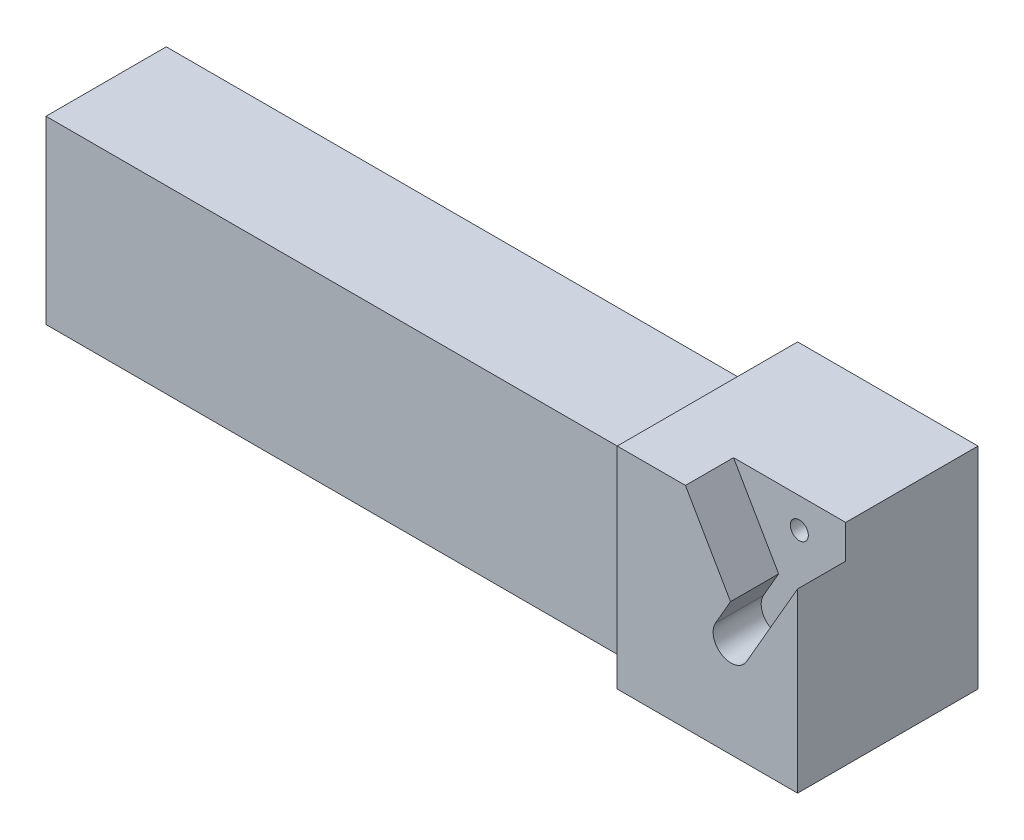
ISO-10303-21;
HEADER;
FILE_DESCRIPTION(('STEP AP214'),'2;1');
FILE_NAME('part.step','',(''),(''),'','','');
FILE_SCHEMA(('AUTOMOTIVE_DESIGN { 1 0 10303 214 1 1 1 1 }'));
ENDSEC;
DATA;
#1=APPLICATION_CONTEXT('core data for automotive mechanical design processes');
#2=APPLICATION_PROTOCOL_DEFINITION('international standard','automotive_design',2000,#1);
#3=PRODUCT_CONTEXT('',#1,'mechanical');
#4=PRODUCT('Part','Part','',(#3));
#5=PRODUCT_RELATED_PRODUCT_CATEGORY('part','',(#4));
#6=PRODUCT_DEFINITION_FORMATION('','',#4);
#7=PRODUCT_DEFINITION_CONTEXT('part definition',#1,'design');
#8=PRODUCT_DEFINITION('design','',#6,#7);
#9=PRODUCT_DEFINITION_SHAPE('','',#8);
#10=(LENGTH_UNIT() NAMED_UNIT(*) SI_UNIT(.MILLI.,.METRE.));
#11=(NAMED_UNIT(*) PLANE_ANGLE_UNIT() SI_UNIT($,.RADIAN.));
#12=(NAMED_UNIT(*) SI_UNIT($,.STERADIAN.) SOLID_ANGLE_UNIT());
#13=UNCERTAINTY_MEASURE_WITH_UNIT(LENGTH_MEASURE(1.E-05),#10,'distance_accuracy_value','');
#14=(GEOMETRIC_REPRESENTATION_CONTEXT(3) GLOBAL_UNCERTAINTY_ASSIGNED_CONTEXT((#13)) GLOBAL_UNIT_ASSIGNED_CONTEXT((#10,
#11,#12)) REPRESENTATION_CONTEXT('',''));
#15=CARTESIAN_POINT('',(0.,0.,0.));
#16=DIRECTION('',(0.,0.,1.));
#17=DIRECTION('',(1.,0.,0.));
#18=AXIS2_PLACEMENT_3D('',#15,#16,#17);
#19=CARTESIAN_POINT('',(-45.,15.,20.));
#20=DIRECTION('',(0.,-1.,0.));
#21=DIRECTION('',(0.,0.,-1.));
#22=AXIS2_PLACEMENT_3D('',#19,#20,#21);
#23=PLANE('',#22);
#24=DIRECTION('',(-1.,0.,0.));
#25=VECTOR('',#24,1.);
#26=CARTESIAN_POINT('',(-45.,15.,20.));
#27=LINE('',#26,#25);
#28=CARTESIAN_POINT('',(50.,15.,20.));
#29=VERTEX_POINT('',#28);
#30=CARTESIAN_POINT('',(-45.,15.,20.));
#31=VERTEX_POINT('',#30);
#32=EDGE_CURVE('E192',#29,#31,#27,.T.);
#33=ORIENTED_EDGE('',*,*,#32,.F.);
#34=DIRECTION('',(0.,0.,-1.));
#35=VECTOR('',#34,1.);
#36=CARTESIAN_POINT('',(50.,15.,0.));
#37=LINE('',#36,#35);
#38=CARTESIAN_POINT('',(50.,15.,0.));
#39=VERTEX_POINT('',#38);
#40=EDGE_CURVE('E216',#29,#39,#37,.T.);
#41=ORIENTED_EDGE('',*,*,#40,.T.);
#42=DIRECTION('',(-1.,0.,0.));
#43=VECTOR('',#42,1.);
#44=CARTESIAN_POINT('',(-45.,15.,0.));
#45=LINE('',#44,#43);
#46=CARTESIAN_POINT('',(-45.,15.,0.));
#47=VERTEX_POINT('',#46);
#48=EDGE_CURVE('E191',#39,#47,#45,.T.);
#49=ORIENTED_EDGE('',*,*,#48,.T.);
#50=DIRECTION('',(0.,0.,-1.));
#51=VECTOR('',#50,1.);
#52=CARTESIAN_POINT('',(-45.,15.,20.));
#53=LINE('',#52,#51);
#54=EDGE_CURVE('E204',#31,#47,#53,.T.);
#55=ORIENTED_EDGE('',*,*,#54,.F.);
#56=EDGE_LOOP('',(#33,#41,#49,#55));
#57=FACE_BOUND('',#56,.T.);
#58=ADVANCED_FACE('F36',(#57),#23,.F.);
#59=CARTESIAN_POINT('',(-45.,15.,20.));
#60=DIRECTION('',(1.,0.,0.));
#61=DIRECTION('',(0.,1.,0.));
#62=AXIS2_PLACEMENT_3D('',#59,#60,#61);
#63=PLANE('',#62);
#64=DIRECTION('',(0.,-1.,0.));
#65=VECTOR('',#64,1.);
#66=CARTESIAN_POINT('',(-45.,15.,0.));
#67=LINE('',#66,#65);
#68=CARTESIAN_POINT('',(-45.,-15.,0.));
#69=VERTEX_POINT('',#68);
#70=EDGE_CURVE('E199',#47,#69,#67,.T.);
#71=ORIENTED_EDGE('',*,*,#70,.T.);
#72=DIRECTION('',(0.,0.,-1.));
#73=VECTOR('',#72,1.);
#74=CARTESIAN_POINT('',(-45.,-15.,20.));
#75=LINE('',#74,#73);
#76=CARTESIAN_POINT('',(-45.,-15.,20.));
#77=VERTEX_POINT('',#76);
#78=EDGE_CURVE('E201',#77,#69,#75,.T.);
#79=ORIENTED_EDGE('',*,*,#78,.F.);
#80=DIRECTION('',(0.,-1.,0.));
#81=VECTOR('',#80,1.);
#82=CARTESIAN_POINT('',(-45.,15.,20.));
#83=LINE('',#82,#81);
#84=EDGE_CURVE('E194',#31,#77,#83,.T.);
#85=ORIENTED_EDGE('',*,*,#84,.F.);
#86=ORIENTED_EDGE('',*,*,#54,.T.);
#87=EDGE_LOOP('',(#71,#79,#85,#86));
#88=FACE_BOUND('',#87,.T.);
#89=ADVANCED_FACE('F281',(#88),#63,.F.);
#90=CARTESIAN_POINT('',(-45.,-15.,20.));
#91=DIRECTION('',(0.,1.,0.));
#92=DIRECTION('',(0.,0.,1.));
#93=AXIS2_PLACEMENT_3D('',#90,#91,#92);
#94=PLANE('',#93);
#95=DIRECTION('',(1.,0.,0.));
#96=VECTOR('',#95,1.);
#97=CARTESIAN_POINT('',(-45.,-15.,0.));
#98=LINE('',#97,#96);
#99=CARTESIAN_POINT('',(50.,-15.,0.));
#100=VERTEX_POINT('',#99);
#101=EDGE_CURVE('E195',#69,#100,#98,.T.);
#102=ORIENTED_EDGE('',*,*,#101,.T.);
#103=CARTESIAN_POINT('',(50.,-15.,-5.));
#104=DIRECTION('',(0.,1.,0.));
#105=DIRECTION('',(0.,0.,1.));
#106=AXIS2_PLACEMENT_3D('',#103,#104,#105);
#107=CIRCLE('',#106,5.);
#108=CARTESIAN_POINT('',(55.,-15.,-5.));
#109=VERTEX_POINT('',#108);
#110=EDGE_CURVE('E45',#100,#109,#107,.T.);
#111=ORIENTED_EDGE('',*,*,#110,.T.);
#112=DIRECTION('',(-1.,0.,0.));
#113=VECTOR('',#112,1.);
#114=CARTESIAN_POINT('',(85.,-15.,-5.));
#115=LINE('',#114,#113);
#116=CARTESIAN_POINT('',(85.,-15.,-5.));
#117=VERTEX_POINT('',#116);
#118=EDGE_CURVE('E186',#117,#109,#115,.T.);
#119=ORIENTED_EDGE('',*,*,#118,.F.);
#120=DIRECTION('',(0.,0.,-1.));
#121=VECTOR('',#120,1.);
#122=CARTESIAN_POINT('',(85.,-15.,25.));
#123=LINE('',#122,#121);
#124=CARTESIAN_POINT('',(85.,-15.,25.));
#125=VERTEX_POINT('',#124);
#126=EDGE_CURVE('E168',#125,#117,#123,.T.);
#127=ORIENTED_EDGE('',*,*,#126,.F.);
#128=DIRECTION('',(-1.,0.,0.));
#129=VECTOR('',#128,1.);
#130=CARTESIAN_POINT('',(85.,-15.,25.));
#131=LINE('',#130,#129);
#132=CARTESIAN_POINT('',(55.,-15.,25.));
#133=VERTEX_POINT('',#132);
#134=EDGE_CURVE('E189',#125,#133,#131,.T.);
#135=ORIENTED_EDGE('',*,*,#134,.T.);
#136=CARTESIAN_POINT('',(50.,-15.,25.));
#137=DIRECTION('',(0.,1.,0.));
#138=DIRECTION('',(0.,0.,1.));
#139=AXIS2_PLACEMENT_3D('',#136,#137,#138);
#140=CIRCLE('',#139,5.);
#141=CARTESIAN_POINT('',(50.,-15.,20.));
#142=VERTEX_POINT('',#141);
#143=EDGE_CURVE('E11',#133,#142,#140,.T.);
#144=ORIENTED_EDGE('',*,*,#143,.T.);
#145=DIRECTION('',(1.,0.,0.));
#146=VECTOR('',#145,1.);
#147=CARTESIAN_POINT('',(-45.,-15.,20.));
#148=LINE('',#147,#146);
#149=EDGE_CURVE('E197',#77,#142,#148,.T.);
#150=ORIENTED_EDGE('',*,*,#149,.F.);
#151=ORIENTED_EDGE('',*,*,#78,.T.);
#152=EDGE_LOOP('',(#102,#111,#119,#127,#135,#144,#150,#151));
#153=FACE_BOUND('',#152,.T.);
#154=ADVANCED_FACE('F287',(#153),#94,.F.);
#155=CARTESIAN_POINT('',(0.,0.,20.));
#156=DIRECTION('',(0.,0.,1.));
#157=DIRECTION('',(1.,0.,0.));
#158=AXIS2_PLACEMENT_3D('',#155,#156,#157);
#159=PLANE('',#158);
#160=ORIENTED_EDGE('',*,*,#149,.T.);
#161=DIRECTION('',(0.,1.,0.));
#162=VECTOR('',#161,1.);
#163=CARTESIAN_POINT('',(50.,0.,20.));
#164=LINE('',#163,#162);
#165=EDGE_CURVE('E218',#142,#29,#164,.T.);
#166=ORIENTED_EDGE('',*,*,#165,.T.);
#167=ORIENTED_EDGE('',*,*,#32,.T.);
#168=ORIENTED_EDGE('',*,*,#84,.T.);
#169=EDGE_LOOP('',(#160,#166,#167,#168));
#170=FACE_BOUND('',#169,.T.);
#171=ADVANCED_FACE('F323',(#170),#159,.T.);
#172=CARTESIAN_POINT('',(0.,0.,0.));
#173=DIRECTION('',(0.,0.,1.));
#174=DIRECTION('',(1.,0.,0.));
#175=AXIS2_PLACEMENT_3D('',#172,#173,#174);
#176=PLANE('',#175);
#177=ORIENTED_EDGE('',*,*,#48,.F.);
#178=DIRECTION('',(0.,1.,0.));
#179=VECTOR('',#178,1.);
#180=CARTESIAN_POINT('',(50.,-15.,0.));
#181=LINE('',#180,#179);
#182=EDGE_CURVE('E207',#39,#100,#181,.F.);
#183=ORIENTED_EDGE('',*,*,#182,.T.);
#184=ORIENTED_EDGE('',*,*,#101,.F.);
#185=ORIENTED_EDGE('',*,*,#70,.F.);
#186=EDGE_LOOP('',(#177,#183,#184,#185));
#187=FACE_BOUND('',#186,.T.);
#188=ADVANCED_FACE('F319',(#187),#176,.F.);
#189=CARTESIAN_POINT('',(85.,20.,25.));
#190=DIRECTION('',(0.,0.,-1.));
#191=DIRECTION('',(-1.,0.,0.));
#192=AXIS2_PLACEMENT_3D('',#189,#190,#191);
#193=PLANE('',#192);
#194=DIRECTION('',(0.,-1.,0.));
#195=VECTOR('',#194,1.);
#196=CARTESIAN_POINT('',(85.,20.,25.));
#197=LINE('',#196,#195);
#198=CARTESIAN_POINT('',(85.,14.4243961213754,25.));
#199=VERTEX_POINT('',#198);
#200=EDGE_CURVE('E166',#199,#125,#197,.T.);
#201=ORIENTED_EDGE('',*,*,#200,.F.);
#202=DIRECTION('',(0.499999999999999,0.866025403784439,0.));
#203=VECTOR('',#202,1.);
#204=CARTESIAN_POINT('',(78.3560927571956,2.91681121606329,25.));
#205=LINE('',#204,#203);
#206=CARTESIAN_POINT('',(76.5,-0.298035742960059,25.));
#207=VERTEX_POINT('',#206);
#208=EDGE_CURVE('E153',#207,#199,#205,.T.);
#209=ORIENTED_EDGE('',*,*,#208,.F.);
#210=CARTESIAN_POINT('',(73.921385399672,1.19072809067559,25.));
#211=DIRECTION('',(0.,0.,1.));
#212=DIRECTION('',(1.,0.,0.));
#213=AXIS2_PLACEMENT_3D('',#210,#211,#212);
#214=CIRCLE('',#213,2.97752766727131);
#215=CARTESIAN_POINT('',(71.342770799344,2.67949192431123,25.));
#216=VERTEX_POINT('',#215);
#217=EDGE_CURVE('E240',#216,#207,#214,.T.);
#218=ORIENTED_EDGE('',*,*,#217,.F.);
#219=DIRECTION('',(-0.499999999999997,-0.86602540378444,0.));
#220=VECTOR('',#219,1.);
#221=CARTESIAN_POINT('',(73.842770799344,7.00961894323346,25.));
#222=LINE('',#221,#220);
#223=CARTESIAN_POINT('',(73.842770799344,7.00961894323346,25.));
#224=VERTEX_POINT('',#223);
#225=EDGE_CURVE('E246',#224,#216,#222,.T.);
#226=ORIENTED_EDGE('',*,*,#225,.F.);
#227=DIRECTION('',(0.500000000000003,-0.866025403784437,0.));
#228=VECTOR('',#227,1.);
#229=CARTESIAN_POINT('',(73.842770799344,7.00961894323346,25.));
#230=LINE('',#229,#228);
#231=CARTESIAN_POINT('',(66.342770799344,20.,25.));
#232=VERTEX_POINT('',#231);
#233=EDGE_CURVE('E249',#232,#224,#230,.T.);
#234=ORIENTED_EDGE('',*,*,#233,.F.);
#235=DIRECTION('',(-1.,0.,0.));
#236=VECTOR('',#235,1.);
#237=CARTESIAN_POINT('',(85.,20.,25.));
#238=LINE('',#237,#236);
#239=CARTESIAN_POINT('',(55.,20.,25.));
#240=VERTEX_POINT('',#239);
#241=EDGE_CURVE('E158',#232,#240,#238,.T.);
#242=ORIENTED_EDGE('',*,*,#241,.T.);
#243=DIRECTION('',(0.,-1.,0.));
#244=VECTOR('',#243,1.);
#245=CARTESIAN_POINT('',(55.,20.,25.));
#246=LINE('',#245,#244);
#247=EDGE_CURVE('E175',#240,#133,#246,.T.);
#248=ORIENTED_EDGE('',*,*,#247,.T.);
#249=ORIENTED_EDGE('',*,*,#134,.F.);
#250=EDGE_LOOP('',(#201,#209,#218,#226,#234,#242,#248,#249));
#251=FACE_BOUND('',#250,.T.);
#252=ADVANCED_FACE('F251',(#251),#193,.F.);
#253=CARTESIAN_POINT('',(85.,-15.,-5.));
#254=DIRECTION('',(0.,0.,1.));
#255=DIRECTION('',(1.,0.,0.));
#256=AXIS2_PLACEMENT_3D('',#253,#254,#255);
#257=PLANE('',#256);
#258=CARTESIAN_POINT('',(77.2809235997813,15.0145636086909,-5.));
#259=DIRECTION('',(0.,0.,1.));
#260=DIRECTION('',(1.,0.,0.));
#261=AXIS2_PLACEMENT_3D('',#258,#259,#260);
#262=CIRCLE('',#261,1.5);
#263=CARTESIAN_POINT('',(78.7809235997813,15.0145636086909,-5.));
#264=VERTEX_POINT('',#263);
#265=EDGE_CURVE('E253',#264,#264,#262,.T.);
#266=ORIENTED_EDGE('',*,*,#265,.T.);
#267=EDGE_LOOP('',(#266));
#268=FACE_BOUND('',#267,.T.);
#269=DIRECTION('',(0.,1.,0.));
#270=VECTOR('',#269,1.);
#271=CARTESIAN_POINT('',(55.,-15.,-5.));
#272=LINE('',#271,#270);
#273=CARTESIAN_POINT('',(55.,20.,-5.));
#274=VERTEX_POINT('',#273);
#275=EDGE_CURVE('E178',#109,#274,#272,.T.);
#276=ORIENTED_EDGE('',*,*,#275,.T.);
#277=DIRECTION('',(-1.,0.,0.));
#278=VECTOR('',#277,1.);
#279=CARTESIAN_POINT('',(85.,20.,-5.));
#280=LINE('',#279,#278);
#281=CARTESIAN_POINT('',(85.,20.,-5.));
#282=VERTEX_POINT('',#281);
#283=EDGE_CURVE('E183',#282,#274,#280,.T.);
#284=ORIENTED_EDGE('',*,*,#283,.F.);
#285=DIRECTION('',(0.,1.,0.));
#286=VECTOR('',#285,1.);
#287=CARTESIAN_POINT('',(85.,-15.,-5.));
#288=LINE('',#287,#286);
#289=EDGE_CURVE('E171',#117,#282,#288,.T.);
#290=ORIENTED_EDGE('',*,*,#289,.F.);
#291=ORIENTED_EDGE('',*,*,#118,.T.);
#292=EDGE_LOOP('',(#276,#284,#290,#291));
#293=FACE_BOUND('',#292,.T.);
#294=ADVANCED_FACE('F264',(#268,#293),#257,.F.);
#295=CARTESIAN_POINT('',(85.,20.,-5.));
#296=DIRECTION('',(0.,-1.,0.));
#297=DIRECTION('',(1.,0.,0.));
#298=AXIS2_PLACEMENT_3D('',#295,#296,#297);
#299=PLANE('',#298);
#300=ORIENTED_EDGE('',*,*,#241,.F.);
#301=DIRECTION('',(0.,0.,1.));
#302=VECTOR('',#301,1.);
#303=CARTESIAN_POINT('',(66.342770799344,20.,17.));
#304=LINE('',#303,#302);
#305=CARTESIAN_POINT('',(66.342770799344,20.,17.));
#306=VERTEX_POINT('',#305);
#307=EDGE_CURVE('E137',#306,#232,#304,.T.);
#308=ORIENTED_EDGE('',*,*,#307,.F.);
#309=DIRECTION('',(-1.,0.,0.));
#310=VECTOR('',#309,1.);
#311=CARTESIAN_POINT('',(66.342770799344,20.,17.));
#312=LINE('',#311,#310);
#313=CARTESIAN_POINT('',(85.,20.,17.));
#314=VERTEX_POINT('',#313);
#315=EDGE_CURVE('E144',#314,#306,#312,.T.);
#316=ORIENTED_EDGE('',*,*,#315,.F.);
#317=DIRECTION('',(0.,0.,1.));
#318=VECTOR('',#317,1.);
#319=CARTESIAN_POINT('',(85.,20.,-5.));
#320=LINE('',#319,#318);
#321=EDGE_CURVE('E173',#282,#314,#320,.T.);
#322=ORIENTED_EDGE('',*,*,#321,.F.);
#323=ORIENTED_EDGE('',*,*,#283,.T.);
#324=DIRECTION('',(0.,0.,1.));
#325=VECTOR('',#324,1.);
#326=CARTESIAN_POINT('',(55.,20.,-5.));
#327=LINE('',#326,#325);
#328=EDGE_CURVE('E169',#274,#240,#327,.T.);
#329=ORIENTED_EDGE('',*,*,#328,.T.);
#330=EDGE_LOOP('',(#300,#308,#316,#322,#323,#329));
#331=FACE_BOUND('',#330,.T.);
#332=ADVANCED_FACE('F156',(#331),#299,.F.);
#333=CARTESIAN_POINT('',(85.,0.,0.));
#334=DIRECTION('',(1.,0.,0.));
#335=DIRECTION('',(0.,1.,0.));
#336=AXIS2_PLACEMENT_3D('',#333,#334,#335);
#337=PLANE('',#336);
#338=DIRECTION('',(0.,0.,1.));
#339=VECTOR('',#338,1.);
#340=CARTESIAN_POINT('',(85.,14.4243961213754,17.));
#341=LINE('',#340,#339);
#342=CARTESIAN_POINT('',(85.,14.4243961213754,17.));
#343=VERTEX_POINT('',#342);
#344=EDGE_CURVE('E53',#343,#199,#341,.T.);
#345=ORIENTED_EDGE('',*,*,#344,.T.);
#346=ORIENTED_EDGE('',*,*,#200,.T.);
#347=ORIENTED_EDGE('',*,*,#126,.T.);
#348=ORIENTED_EDGE('',*,*,#289,.T.);
#349=ORIENTED_EDGE('',*,*,#321,.T.);
#350=DIRECTION('',(0.,1.,0.));
#351=VECTOR('',#350,1.);
#352=CARTESIAN_POINT('',(85.,20.,17.));
#353=LINE('',#352,#351);
#354=EDGE_CURVE('E149',#343,#314,#353,.T.);
#355=ORIENTED_EDGE('',*,*,#354,.F.);
#356=EDGE_LOOP('',(#345,#346,#347,#348,#349,#355));
#357=FACE_BOUND('',#356,.T.);
#358=ADVANCED_FACE('F302',(#357),#337,.T.);
#359=CARTESIAN_POINT('',(50.,0.,25.));
#360=DIRECTION('',(0.,1.,0.));
#361=DIRECTION('',(-1.,0.,0.));
#362=AXIS2_PLACEMENT_3D('',#359,#360,#361);
#363=CYLINDRICAL_SURFACE('',#362,5.);
#364=ORIENTED_EDGE('',*,*,#143,.F.);
#365=ORIENTED_EDGE('',*,*,#247,.F.);
#366=CARTESIAN_POINT('',(50.,20.,25.));
#367=DIRECTION('',(0.,0.707106781186547,-0.707106781186547));
#368=DIRECTION('',(0.,0.707106781186547,0.707106781186547));
#369=AXIS2_PLACEMENT_3D('',#366,#367,#368);
#370=ELLIPSE('',#369,7.07106781186547,5.);
#371=EDGE_CURVE('E40',#29,#240,#370,.F.);
#372=ORIENTED_EDGE('',*,*,#371,.F.);
#373=ORIENTED_EDGE('',*,*,#165,.F.);
#374=EDGE_LOOP('',(#364,#365,#372,#373));
#375=FACE_BOUND('',#374,.T.);
#376=ADVANCED_FACE('F38',(#375),#363,.F.);
#377=CARTESIAN_POINT('',(50.,20.,20.));
#378=DIRECTION('',(0.,0.,1.));
#379=DIRECTION('',(1.,0.,0.));
#380=AXIS2_PLACEMENT_3D('',#377,#378,#379);
#381=CYLINDRICAL_SURFACE('',#380,5.);
#382=ORIENTED_EDGE('',*,*,#371,.T.);
#383=ORIENTED_EDGE('',*,*,#328,.F.);
#384=CARTESIAN_POINT('',(50.,20.,-5.));
#385=DIRECTION('',(0.,0.707106781186547,0.707106781186547));
#386=DIRECTION('',(0.,-0.707106781186547,0.707106781186547));
#387=AXIS2_PLACEMENT_3D('',#384,#385,#386);
#388=ELLIPSE('',#387,7.07106781186547,5.);
#389=EDGE_CURVE('E220',#39,#274,#388,.T.);
#390=ORIENTED_EDGE('',*,*,#389,.F.);
#391=ORIENTED_EDGE('',*,*,#40,.F.);
#392=EDGE_LOOP('',(#382,#383,#390,#391));
#393=FACE_BOUND('',#392,.T.);
#394=ADVANCED_FACE('F296',(#393),#381,.F.);
#395=CARTESIAN_POINT('',(50.,0.,-5.));
#396=DIRECTION('',(0.,-1.,0.));
#397=DIRECTION('',(1.,0.,0.));
#398=AXIS2_PLACEMENT_3D('',#395,#396,#397);
#399=CYLINDRICAL_SURFACE('',#398,5.);
#400=ORIENTED_EDGE('',*,*,#110,.F.);
#401=ORIENTED_EDGE('',*,*,#182,.F.);
#402=ORIENTED_EDGE('',*,*,#389,.T.);
#403=ORIENTED_EDGE('',*,*,#275,.F.);
#404=EDGE_LOOP('',(#400,#401,#402,#403));
#405=FACE_BOUND('',#404,.T.);
#406=ADVANCED_FACE('F293',(#405),#399,.F.);
#407=CARTESIAN_POINT('',(78.3560927571956,2.91681121606329,17.));
#408=DIRECTION('',(0.866025403784439,-0.499999999999999,0.));
#409=DIRECTION('',(0.499999999999999,0.866025403784439,0.));
#410=AXIS2_PLACEMENT_3D('',#407,#408,#409);
#411=PLANE('',#410);
#412=ORIENTED_EDGE('',*,*,#208,.T.);
#413=ORIENTED_EDGE('',*,*,#344,.F.);
#414=DIRECTION('',(0.499999999999998,0.86602540378444,0.));
#415=VECTOR('',#414,1.);
#416=CARTESIAN_POINT('',(78.3560927571956,2.91681121606329,17.));
#417=LINE('',#416,#415);
#418=CARTESIAN_POINT('',(76.5,-0.298035742960059,17.));
#419=VERTEX_POINT('',#418);
#420=EDGE_CURVE('E162',#419,#343,#417,.T.);
#421=ORIENTED_EDGE('',*,*,#420,.F.);
#422=DIRECTION('',(0.,0.,1.));
#423=VECTOR('',#422,1.);
#424=CARTESIAN_POINT('',(76.5,-0.298035742960059,17.));
#425=LINE('',#424,#423);
#426=EDGE_CURVE('E227',#419,#207,#425,.T.);
#427=ORIENTED_EDGE('',*,*,#426,.T.);
#428=EDGE_LOOP('',(#412,#413,#421,#427));
#429=FACE_BOUND('',#428,.T.);
#430=ADVANCED_FACE('F295',(#429),#411,.F.);
#431=CARTESIAN_POINT('',(73.921385399672,1.19072809067559,17.));
#432=DIRECTION('',(0.,0.,1.));
#433=DIRECTION('',(1.,0.,0.));
#434=AXIS2_PLACEMENT_3D('',#431,#432,#433);
#435=CYLINDRICAL_SURFACE('',#434,2.97752766727131);
#436=ORIENTED_EDGE('',*,*,#217,.T.);
#437=ORIENTED_EDGE('',*,*,#426,.F.);
#438=CARTESIAN_POINT('',(73.921385399672,1.19072809067559,17.));
#439=DIRECTION('',(0.,0.,1.));
#440=DIRECTION('',(1.,0.,0.));
#441=AXIS2_PLACEMENT_3D('',#438,#439,#440);
#442=CIRCLE('',#441,2.97752766727131);
#443=CARTESIAN_POINT('',(71.342770799344,2.67949192431123,17.));
#444=VERTEX_POINT('',#443);
#445=EDGE_CURVE('E243',#444,#419,#442,.T.);
#446=ORIENTED_EDGE('',*,*,#445,.F.);
#447=DIRECTION('',(0.,0.,1.));
#448=VECTOR('',#447,1.);
#449=CARTESIAN_POINT('',(71.342770799344,2.67949192431123,17.));
#450=LINE('',#449,#448);
#451=EDGE_CURVE('E160',#444,#216,#450,.T.);
#452=ORIENTED_EDGE('',*,*,#451,.T.);
#453=EDGE_LOOP('',(#436,#437,#446,#452));
#454=FACE_BOUND('',#453,.T.);
#455=ADVANCED_FACE('F238',(#454),#435,.F.);
#456=CARTESIAN_POINT('',(73.842770799344,7.00961894323346,17.));
#457=DIRECTION('',(-0.86602540378444,0.499999999999997,0.));
#458=DIRECTION('',(-0.499999999999997,-0.86602540378444,0.));
#459=AXIS2_PLACEMENT_3D('',#456,#457,#458);
#460=PLANE('',#459);
#461=ORIENTED_EDGE('',*,*,#225,.T.);
#462=ORIENTED_EDGE('',*,*,#451,.F.);
#463=DIRECTION('',(-0.499999999999997,-0.86602540378444,0.));
#464=VECTOR('',#463,1.);
#465=CARTESIAN_POINT('',(73.842770799344,7.00961894323346,17.));
#466=LINE('',#465,#464);
#467=CARTESIAN_POINT('',(73.842770799344,7.00961894323346,17.));
#468=VERTEX_POINT('',#467);
#469=EDGE_CURVE('E143',#468,#444,#466,.T.);
#470=ORIENTED_EDGE('',*,*,#469,.F.);
#471=DIRECTION('',(0.,0.,1.));
#472=VECTOR('',#471,1.);
#473=CARTESIAN_POINT('',(73.842770799344,7.00961894323346,17.));
#474=LINE('',#473,#472);
#475=EDGE_CURVE('E139',#468,#224,#474,.T.);
#476=ORIENTED_EDGE('',*,*,#475,.T.);
#477=EDGE_LOOP('',(#461,#462,#470,#476));
#478=FACE_BOUND('',#477,.T.);
#479=ADVANCED_FACE('F247',(#478),#460,.F.);
#480=CARTESIAN_POINT('',(73.842770799344,7.00961894323346,17.));
#481=DIRECTION('',(-0.866025403784437,-0.500000000000003,0.));
#482=DIRECTION('',(0.500000000000003,-0.866025403784437,0.));
#483=AXIS2_PLACEMENT_3D('',#480,#481,#482);
#484=PLANE('',#483);
#485=ORIENTED_EDGE('',*,*,#233,.T.);
#486=ORIENTED_EDGE('',*,*,#475,.F.);
#487=DIRECTION('',(0.500000000000003,-0.866025403784437,0.));
#488=VECTOR('',#487,1.);
#489=CARTESIAN_POINT('',(73.842770799344,7.00961894323346,17.));
#490=LINE('',#489,#488);
#491=EDGE_CURVE('E132',#306,#468,#490,.T.);
#492=ORIENTED_EDGE('',*,*,#491,.F.);
#493=ORIENTED_EDGE('',*,*,#307,.T.);
#494=EDGE_LOOP('',(#485,#486,#492,#493));
#495=FACE_BOUND('',#494,.T.);
#496=ADVANCED_FACE('F135',(#495),#484,.F.);
#497=CARTESIAN_POINT('',(73.921385399672,1.19072809067559,17.));
#498=DIRECTION('',(0.,0.,1.));
#499=DIRECTION('',(1.,0.,0.));
#500=AXIS2_PLACEMENT_3D('',#497,#498,#499);
#501=PLANE('',#500);
#502=CARTESIAN_POINT('',(77.2809235997813,15.0145636086909,17.));
#503=DIRECTION('',(0.,0.,1.));
#504=DIRECTION('',(1.,0.,0.));
#505=AXIS2_PLACEMENT_3D('',#502,#503,#504);
#506=CIRCLE('',#505,1.5);
#507=CARTESIAN_POINT('',(78.7809235997813,15.0145636086909,17.));
#508=VERTEX_POINT('',#507);
#509=EDGE_CURVE('E258',#508,#508,#506,.T.);
#510=ORIENTED_EDGE('',*,*,#509,.F.);
#511=EDGE_LOOP('',(#510));
#512=FACE_BOUND('',#511,.T.);
#513=ORIENTED_EDGE('',*,*,#315,.T.);
#514=ORIENTED_EDGE('',*,*,#491,.T.);
#515=ORIENTED_EDGE('',*,*,#469,.T.);
#516=ORIENTED_EDGE('',*,*,#445,.T.);
#517=ORIENTED_EDGE('',*,*,#420,.T.);
#518=ORIENTED_EDGE('',*,*,#354,.T.);
#519=EDGE_LOOP('',(#513,#514,#515,#516,#517,#518));
#520=FACE_BOUND('',#519,.T.);
#521=ADVANCED_FACE('F147',(#512,#520),#501,.T.);
#522=CARTESIAN_POINT('',(77.2809235997813,15.0145636086909,-5.));
#523=DIRECTION('',(0.,0.,1.));
#524=DIRECTION('',(1.,0.,0.));
#525=AXIS2_PLACEMENT_3D('',#522,#523,#524);
#526=CYLINDRICAL_SURFACE('',#525,1.5);
#527=ORIENTED_EDGE('',*,*,#265,.F.);
#528=EDGE_LOOP('',(#527));
#529=FACE_BOUND('',#528,.T.);
#530=ORIENTED_EDGE('',*,*,#509,.T.);
#531=EDGE_LOOP('',(#530));
#532=FACE_BOUND('',#531,.T.);
#533=ADVANCED_FACE('F267',(#529,#532),#526,.F.);
#534=CLOSED_SHELL('',(#58,#89,#154,#171,#188,#252,#294,#332,#358,#376,#394,#406,#430,#455,#479,
#496,#521,#533));
#535=MANIFOLD_SOLID_BREP('B2',#534);
#536=ADVANCED_BREP_SHAPE_REPRESENTATION('',(#18,#535),#14);
#537=SHAPE_DEFINITION_REPRESENTATION(#9,#536);
ENDSEC;
END-ISO-10303-21;
